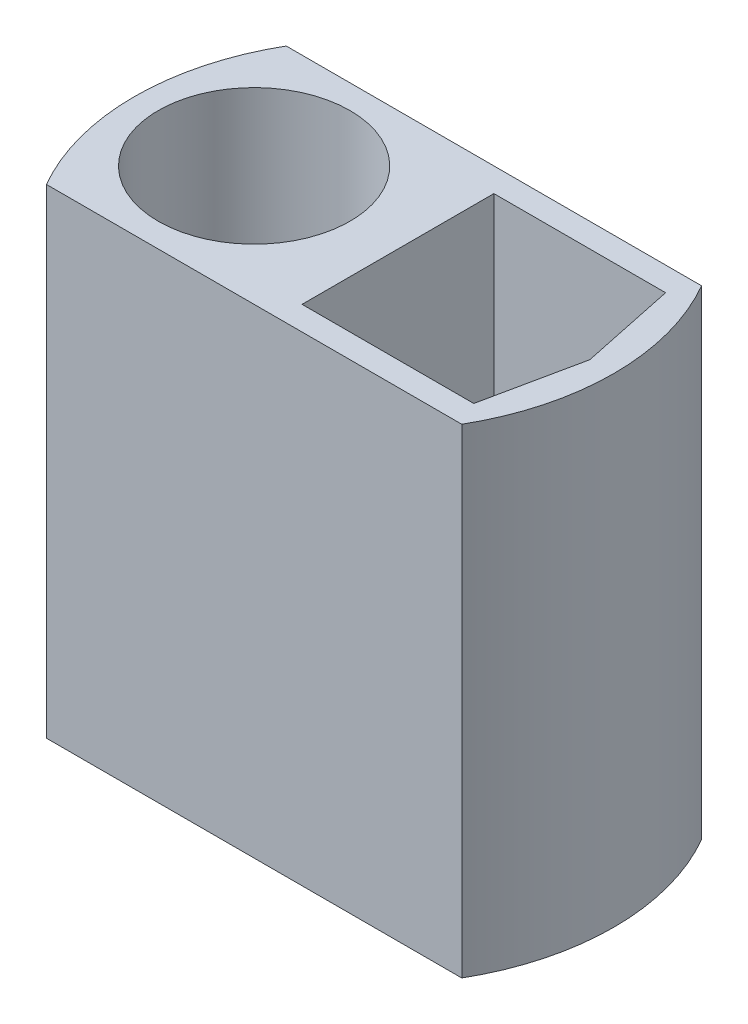
ISO-10303-21;
HEADER;
FILE_DESCRIPTION(('STEP AP214'),'2;1');
FILE_NAME('part.step','',(''),(''),'','','');
FILE_SCHEMA(('AUTOMOTIVE_DESIGN { 1 0 10303 214 1 1 1 1 }'));
ENDSEC;
DATA;
#1=APPLICATION_CONTEXT('core data for automotive mechanical design processes');
#2=APPLICATION_PROTOCOL_DEFINITION('international standard','automotive_design',2000,#1);
#3=PRODUCT_CONTEXT('',#1,'mechanical');
#4=PRODUCT('Part','Part','',(#3));
#5=PRODUCT_RELATED_PRODUCT_CATEGORY('part','',(#4));
#6=PRODUCT_DEFINITION_FORMATION('','',#4);
#7=PRODUCT_DEFINITION_CONTEXT('part definition',#1,'design');
#8=PRODUCT_DEFINITION('design','',#6,#7);
#9=PRODUCT_DEFINITION_SHAPE('','',#8);
#10=(LENGTH_UNIT() NAMED_UNIT(*) SI_UNIT(.MILLI.,.METRE.));
#11=(NAMED_UNIT(*) PLANE_ANGLE_UNIT() SI_UNIT($,.RADIAN.));
#12=(NAMED_UNIT(*) SI_UNIT($,.STERADIAN.) SOLID_ANGLE_UNIT());
#13=UNCERTAINTY_MEASURE_WITH_UNIT(LENGTH_MEASURE(1.E-05),#10,'distance_accuracy_value','');
#14=(GEOMETRIC_REPRESENTATION_CONTEXT(3) GLOBAL_UNCERTAINTY_ASSIGNED_CONTEXT((#13)) GLOBAL_UNIT_ASSIGNED_CONTEXT((#10,
#11,#12)) REPRESENTATION_CONTEXT('',''));
#15=CARTESIAN_POINT('',(0.,0.,0.));
#16=DIRECTION('',(0.,0.,1.));
#17=DIRECTION('',(1.,0.,0.));
#18=AXIS2_PLACEMENT_3D('',#15,#16,#17);
#19=CARTESIAN_POINT('',(0.,25.4,6.35));
#20=DIRECTION('',(0.,0.,-1.));
#21=DIRECTION('',(-1.,0.,0.));
#22=AXIS2_PLACEMENT_3D('',#19,#20,#21);
#23=PLANE('',#22);
#24=DIRECTION('',(1.,0.,0.));
#25=VECTOR('',#24,1.);
#26=CARTESIAN_POINT('',(0.,0.,6.35));
#27=LINE('',#26,#25);
#28=CARTESIAN_POINT('',(-10.9985226280624,0.,6.35));
#29=VERTEX_POINT('',#28);
#30=CARTESIAN_POINT('',(10.9985226280624,0.,6.35));
#31=VERTEX_POINT('',#30);
#32=EDGE_CURVE('E132',#29,#31,#27,.T.);
#33=ORIENTED_EDGE('',*,*,#32,.T.);
#34=DIRECTION('',(0.,-1.,0.));
#35=VECTOR('',#34,1.);
#36=CARTESIAN_POINT('',(10.9985226280624,25.4,6.35));
#37=LINE('',#36,#35);
#38=CARTESIAN_POINT('',(10.9985226280624,25.4,6.35));
#39=VERTEX_POINT('',#38);
#40=EDGE_CURVE('E43',#39,#31,#37,.T.);
#41=ORIENTED_EDGE('',*,*,#40,.F.);
#42=DIRECTION('',(1.,0.,0.));
#43=VECTOR('',#42,1.);
#44=CARTESIAN_POINT('',(0.,25.4,6.35));
#45=LINE('',#44,#43);
#46=CARTESIAN_POINT('',(-10.9985226280624,25.4,6.35));
#47=VERTEX_POINT('',#46);
#48=EDGE_CURVE('E113',#47,#39,#45,.T.);
#49=ORIENTED_EDGE('',*,*,#48,.F.);
#50=DIRECTION('',(0.,-1.,0.));
#51=VECTOR('',#50,1.);
#52=CARTESIAN_POINT('',(-10.9985226280624,25.4,6.35));
#53=LINE('',#52,#51);
#54=EDGE_CURVE('E139',#47,#29,#53,.T.);
#55=ORIENTED_EDGE('',*,*,#54,.T.);
#56=EDGE_LOOP('',(#33,#41,#49,#55));
#57=FACE_BOUND('',#56,.T.);
#58=ADVANCED_FACE('F35',(#57),#23,.F.);
#59=CARTESIAN_POINT('',(0.,25.4,0.));
#60=DIRECTION('',(0.,-1.,0.));
#61=DIRECTION('',(0.,0.,-1.));
#62=AXIS2_PLACEMENT_3D('',#59,#60,#61);
#63=CYLINDRICAL_SURFACE('',#62,12.7);
#64=CARTESIAN_POINT('',(0.,0.,0.));
#65=DIRECTION('',(0.,1.,0.));
#66=DIRECTION('',(0.,0.,1.));
#67=AXIS2_PLACEMENT_3D('',#64,#65,#66);
#68=CIRCLE('',#67,12.7);
#69=CARTESIAN_POINT('',(10.9985226280624,0.,-6.35));
#70=VERTEX_POINT('',#69);
#71=EDGE_CURVE('E121',#31,#70,#68,.T.);
#72=ORIENTED_EDGE('',*,*,#71,.T.);
#73=DIRECTION('',(0.,-1.,0.));
#74=VECTOR('',#73,1.);
#75=CARTESIAN_POINT('',(10.9985226280624,25.4,-6.35));
#76=LINE('',#75,#74);
#77=CARTESIAN_POINT('',(10.9985226280624,25.4,-6.35));
#78=VERTEX_POINT('',#77);
#79=EDGE_CURVE('E119',#78,#70,#76,.T.);
#80=ORIENTED_EDGE('',*,*,#79,.F.);
#81=CARTESIAN_POINT('',(0.,25.4,0.));
#82=DIRECTION('',(0.,1.,0.));
#83=DIRECTION('',(0.,0.,1.));
#84=AXIS2_PLACEMENT_3D('',#81,#82,#83);
#85=CIRCLE('',#84,12.7);
#86=EDGE_CURVE('E107',#39,#78,#85,.T.);
#87=ORIENTED_EDGE('',*,*,#86,.F.);
#88=ORIENTED_EDGE('',*,*,#40,.T.);
#89=EDGE_LOOP('',(#72,#80,#87,#88));
#90=FACE_BOUND('',#89,.T.);
#91=ADVANCED_FACE('F120',(#90),#63,.T.);
#92=CARTESIAN_POINT('',(0.,25.4,-6.35));
#93=DIRECTION('',(0.,0.,-1.));
#94=DIRECTION('',(-1.,0.,0.));
#95=AXIS2_PLACEMENT_3D('',#92,#93,#94);
#96=PLANE('',#95);
#97=DIRECTION('',(1.,0.,0.));
#98=VECTOR('',#97,1.);
#99=CARTESIAN_POINT('',(0.,0.,-6.35));
#100=LINE('',#99,#98);
#101=CARTESIAN_POINT('',(-10.9985226280624,0.,-6.35));
#102=VERTEX_POINT('',#101);
#103=EDGE_CURVE('E137',#102,#70,#100,.T.);
#104=ORIENTED_EDGE('',*,*,#103,.F.);
#105=DIRECTION('',(0.,-1.,0.));
#106=VECTOR('',#105,1.);
#107=CARTESIAN_POINT('',(-10.9985226280624,25.4,-6.35));
#108=LINE('',#107,#106);
#109=CARTESIAN_POINT('',(-10.9985226280624,25.4,-6.35));
#110=VERTEX_POINT('',#109);
#111=EDGE_CURVE('E125',#110,#102,#108,.T.);
#112=ORIENTED_EDGE('',*,*,#111,.F.);
#113=DIRECTION('',(1.,0.,0.));
#114=VECTOR('',#113,1.);
#115=CARTESIAN_POINT('',(0.,25.4,-6.35));
#116=LINE('',#115,#114);
#117=EDGE_CURVE('E111',#110,#78,#116,.T.);
#118=ORIENTED_EDGE('',*,*,#117,.T.);
#119=ORIENTED_EDGE('',*,*,#79,.T.);
#120=EDGE_LOOP('',(#104,#112,#118,#119));
#121=FACE_BOUND('',#120,.T.);
#122=ADVANCED_FACE('F127',(#121),#96,.T.);
#123=CARTESIAN_POINT('',(0.,25.4,5.08));
#124=DIRECTION('',(0.,0.,1.));
#125=DIRECTION('',(1.,0.,0.));
#126=AXIS2_PLACEMENT_3D('',#123,#124,#125);
#127=PLANE('',#126);
#128=DIRECTION('',(0.,-1.,0.));
#129=VECTOR('',#128,1.);
#130=CARTESIAN_POINT('',(10.3639461184403,25.4,5.08));
#131=LINE('',#130,#129);
#132=CARTESIAN_POINT('',(10.3639461184403,25.4,5.08));
#133=VERTEX_POINT('',#132);
#134=CARTESIAN_POINT('',(10.3639461184403,1.27,5.08));
#135=VERTEX_POINT('',#134);
#136=EDGE_CURVE('E129',#133,#135,#131,.T.);
#137=ORIENTED_EDGE('',*,*,#136,.T.);
#138=DIRECTION('',(-1.,0.,0.));
#139=VECTOR('',#138,1.);
#140=CARTESIAN_POINT('',(0.,1.27,5.08));
#141=LINE('',#140,#139);
#142=CARTESIAN_POINT('',(1.27,1.27,5.08));
#143=VERTEX_POINT('',#142);
#144=EDGE_CURVE('E50',#135,#143,#141,.T.);
#145=ORIENTED_EDGE('',*,*,#144,.T.);
#146=DIRECTION('',(0.,-1.,0.));
#147=VECTOR('',#146,1.);
#148=CARTESIAN_POINT('',(1.27,25.4,5.08));
#149=LINE('',#148,#147);
#150=CARTESIAN_POINT('',(1.27,25.4,5.08));
#151=VERTEX_POINT('',#150);
#152=EDGE_CURVE('E141',#151,#143,#149,.T.);
#153=ORIENTED_EDGE('',*,*,#152,.F.);
#154=DIRECTION('',(-1.,0.,0.));
#155=VECTOR('',#154,1.);
#156=CARTESIAN_POINT('',(0.,25.4,5.08));
#157=LINE('',#156,#155);
#158=EDGE_CURVE('E164',#133,#151,#157,.T.);
#159=ORIENTED_EDGE('',*,*,#158,.F.);
#160=EDGE_LOOP('',(#137,#145,#153,#159));
#161=FACE_BOUND('',#160,.T.);
#162=ADVANCED_FACE('F163',(#161),#127,.F.);
#163=CARTESIAN_POINT('',(1.27,25.4,0.));
#164=DIRECTION('',(-1.,0.,0.));
#165=DIRECTION('',(0.,0.,1.));
#166=AXIS2_PLACEMENT_3D('',#163,#164,#165);
#167=PLANE('',#166);
#168=ORIENTED_EDGE('',*,*,#152,.T.);
#169=DIRECTION('',(0.,0.,-1.));
#170=VECTOR('',#169,1.);
#171=CARTESIAN_POINT('',(1.27,1.27,0.));
#172=LINE('',#171,#170);
#173=CARTESIAN_POINT('',(1.27,1.27,-5.08));
#174=VERTEX_POINT('',#173);
#175=EDGE_CURVE('E158',#143,#174,#172,.T.);
#176=ORIENTED_EDGE('',*,*,#175,.T.);
#177=DIRECTION('',(0.,-1.,0.));
#178=VECTOR('',#177,1.);
#179=CARTESIAN_POINT('',(1.27,25.4,-5.08));
#180=LINE('',#179,#178);
#181=CARTESIAN_POINT('',(1.27,25.4,-5.08));
#182=VERTEX_POINT('',#181);
#183=EDGE_CURVE('E152',#182,#174,#180,.T.);
#184=ORIENTED_EDGE('',*,*,#183,.F.);
#185=DIRECTION('',(0.,0.,-1.));
#186=VECTOR('',#185,1.);
#187=CARTESIAN_POINT('',(1.27,25.4,0.));
#188=LINE('',#187,#186);
#189=EDGE_CURVE('E89',#151,#182,#188,.T.);
#190=ORIENTED_EDGE('',*,*,#189,.F.);
#191=EDGE_LOOP('',(#168,#176,#184,#190));
#192=FACE_BOUND('',#191,.T.);
#193=ADVANCED_FACE('F157',(#192),#167,.F.);
#194=CARTESIAN_POINT('',(0.,25.4,-5.08));
#195=DIRECTION('',(0.,0.,-1.));
#196=DIRECTION('',(-1.,0.,0.));
#197=AXIS2_PLACEMENT_3D('',#194,#195,#196);
#198=PLANE('',#197);
#199=ORIENTED_EDGE('',*,*,#183,.T.);
#200=DIRECTION('',(1.,0.,0.));
#201=VECTOR('',#200,1.);
#202=CARTESIAN_POINT('',(0.,1.27,-5.08));
#203=LINE('',#202,#201);
#204=CARTESIAN_POINT('',(10.3639461184403,1.27,-5.08));
#205=VERTEX_POINT('',#204);
#206=EDGE_CURVE('E176',#174,#205,#203,.T.);
#207=ORIENTED_EDGE('',*,*,#206,.T.);
#208=DIRECTION('',(0.,-1.,0.));
#209=VECTOR('',#208,1.);
#210=CARTESIAN_POINT('',(10.3639461184403,25.4,-5.08));
#211=LINE('',#210,#209);
#212=CARTESIAN_POINT('',(10.3639461184403,25.4,-5.08));
#213=VERTEX_POINT('',#212);
#214=EDGE_CURVE('E149',#213,#205,#211,.T.);
#215=ORIENTED_EDGE('',*,*,#214,.F.);
#216=DIRECTION('',(1.,0.,0.));
#217=VECTOR('',#216,1.);
#218=CARTESIAN_POINT('',(0.,25.4,-5.08));
#219=LINE('',#218,#217);
#220=EDGE_CURVE('E205',#182,#213,#219,.T.);
#221=ORIENTED_EDGE('',*,*,#220,.F.);
#222=EDGE_LOOP('',(#199,#207,#215,#221));
#223=FACE_BOUND('',#222,.T.);
#224=ADVANCED_FACE('F226',(#223),#198,.F.);
#225=CARTESIAN_POINT('',(10.9478738673168,25.4,-2.29744555729909));
#226=DIRECTION('',(0.9786823979135,0.,-0.2053795608484));
#227=DIRECTION('',(-0.2053795608484,0.,-0.9786823979135));
#228=AXIS2_PLACEMENT_3D('',#225,#226,#227);
#229=PLANE('',#228);
#230=ORIENTED_EDGE('',*,*,#214,.T.);
#231=DIRECTION('',(0.2053795608484,0.,0.9786823979135));
#232=VECTOR('',#231,1.);
#233=CARTESIAN_POINT('',(10.9478738673168,1.27,-2.29744555729909));
#234=LINE('',#233,#232);
#235=CARTESIAN_POINT('',(11.43,1.27,0.));
#236=VERTEX_POINT('',#235);
#237=EDGE_CURVE('E168',#205,#236,#234,.T.);
#238=ORIENTED_EDGE('',*,*,#237,.T.);
#239=DIRECTION('',(0.,-1.,0.));
#240=VECTOR('',#239,1.);
#241=CARTESIAN_POINT('',(11.43,25.4,0.));
#242=LINE('',#241,#240);
#243=CARTESIAN_POINT('',(11.43,25.4,0.));
#244=VERTEX_POINT('',#243);
#245=EDGE_CURVE('E146',#244,#236,#242,.T.);
#246=ORIENTED_EDGE('',*,*,#245,.F.);
#247=DIRECTION('',(0.2053795608484,0.,0.9786823979135));
#248=VECTOR('',#247,1.);
#249=CARTESIAN_POINT('',(10.9478738673168,25.4,-2.29744555729909));
#250=LINE('',#249,#248);
#251=EDGE_CURVE('E207',#213,#244,#250,.T.);
#252=ORIENTED_EDGE('',*,*,#251,.F.);
#253=EDGE_LOOP('',(#230,#238,#246,#252));
#254=FACE_BOUND('',#253,.T.);
#255=ADVANCED_FACE('F222',(#254),#229,.F.);
#256=CARTESIAN_POINT('',(10.9478738673168,25.4,2.29744555729909));
#257=DIRECTION('',(0.9786823979135,0.,0.2053795608484));
#258=DIRECTION('',(0.2053795608484,0.,-0.9786823979135));
#259=AXIS2_PLACEMENT_3D('',#256,#257,#258);
#260=PLANE('',#259);
#261=ORIENTED_EDGE('',*,*,#245,.T.);
#262=DIRECTION('',(-0.2053795608484,0.,0.9786823979135));
#263=VECTOR('',#262,1.);
#264=CARTESIAN_POINT('',(10.9478738673168,1.27,2.29744555729909));
#265=LINE('',#264,#263);
#266=EDGE_CURVE('E166',#236,#135,#265,.T.);
#267=ORIENTED_EDGE('',*,*,#266,.T.);
#268=ORIENTED_EDGE('',*,*,#136,.F.);
#269=DIRECTION('',(-0.2053795608484,0.,0.9786823979135));
#270=VECTOR('',#269,1.);
#271=CARTESIAN_POINT('',(10.9478738673168,25.4,2.29744555729909));
#272=LINE('',#271,#270);
#273=EDGE_CURVE('E209',#244,#133,#272,.T.);
#274=ORIENTED_EDGE('',*,*,#273,.F.);
#275=EDGE_LOOP('',(#261,#267,#268,#274));
#276=FACE_BOUND('',#275,.T.);
#277=ADVANCED_FACE('F215',(#276),#260,.F.);
#278=CARTESIAN_POINT('',(-6.35,25.4,0.));
#279=DIRECTION('',(0.,-1.,0.));
#280=DIRECTION('',(0.,0.,-1.));
#281=AXIS2_PLACEMENT_3D('',#278,#279,#280);
#282=CYLINDRICAL_SURFACE('',#281,5.08);
#283=CARTESIAN_POINT('',(-6.35,1.27,0.));
#284=DIRECTION('',(0.,1.,0.));
#285=DIRECTION('',(0.,0.,1.));
#286=AXIS2_PLACEMENT_3D('',#283,#284,#285);
#287=CIRCLE('',#286,5.08);
#288=CARTESIAN_POINT('',(-6.35,1.27,5.08));
#289=VERTEX_POINT('',#288);
#290=EDGE_CURVE('E11',#289,#289,#287,.T.);
#291=ORIENTED_EDGE('',*,*,#290,.F.);
#292=EDGE_LOOP('',(#291));
#293=FACE_BOUND('',#292,.T.);
#294=CARTESIAN_POINT('',(-6.35,25.4,0.));
#295=DIRECTION('',(0.,1.,0.));
#296=DIRECTION('',(0.,0.,1.));
#297=AXIS2_PLACEMENT_3D('',#294,#295,#296);
#298=CIRCLE('',#297,5.08);
#299=CARTESIAN_POINT('',(-6.35,25.4,5.08));
#300=VERTEX_POINT('',#299);
#301=EDGE_CURVE('E200',#300,#300,#298,.T.);
#302=ORIENTED_EDGE('',*,*,#301,.T.);
#303=EDGE_LOOP('',(#302));
#304=FACE_BOUND('',#303,.T.);
#305=ADVANCED_FACE('F37',(#293,#304),#282,.F.);
#306=EDGE_CURVE('E80',#102,#29,#68,.T.);
#307=ORIENTED_EDGE('',*,*,#306,.T.);
#308=ORIENTED_EDGE('',*,*,#54,.F.);
#309=EDGE_CURVE('E59',#110,#47,#85,.T.);
#310=ORIENTED_EDGE('',*,*,#309,.F.);
#311=ORIENTED_EDGE('',*,*,#111,.T.);
#312=EDGE_LOOP('',(#307,#308,#310,#311));
#313=FACE_BOUND('',#312,.T.);
#314=ADVANCED_FACE('F242',(#313),#63,.T.);
#315=CARTESIAN_POINT('',(0.,25.4,0.));
#316=DIRECTION('',(0.,1.,0.));
#317=DIRECTION('',(0.,0.,1.));
#318=AXIS2_PLACEMENT_3D('',#315,#316,#317);
#319=PLANE('',#318);
#320=ORIENTED_EDGE('',*,*,#301,.F.);
#321=EDGE_LOOP('',(#320));
#322=FACE_BOUND('',#321,.T.);
#323=ORIENTED_EDGE('',*,*,#158,.T.);
#324=ORIENTED_EDGE('',*,*,#189,.T.);
#325=ORIENTED_EDGE('',*,*,#220,.T.);
#326=ORIENTED_EDGE('',*,*,#251,.T.);
#327=ORIENTED_EDGE('',*,*,#273,.T.);
#328=EDGE_LOOP('',(#323,#324,#325,#326,#327));
#329=FACE_BOUND('',#328,.T.);
#330=ORIENTED_EDGE('',*,*,#48,.T.);
#331=ORIENTED_EDGE('',*,*,#86,.T.);
#332=ORIENTED_EDGE('',*,*,#117,.F.);
#333=ORIENTED_EDGE('',*,*,#309,.T.);
#334=EDGE_LOOP('',(#330,#331,#332,#333));
#335=FACE_BOUND('',#334,.T.);
#336=ADVANCED_FACE('F109',(#322,#329,#335),#319,.T.);
#337=CARTESIAN_POINT('',(0.,0.,0.));
#338=DIRECTION('',(0.,1.,0.));
#339=DIRECTION('',(0.,0.,1.));
#340=AXIS2_PLACEMENT_3D('',#337,#338,#339);
#341=PLANE('',#340);
#342=ORIENTED_EDGE('',*,*,#32,.F.);
#343=ORIENTED_EDGE('',*,*,#306,.F.);
#344=ORIENTED_EDGE('',*,*,#103,.T.);
#345=ORIENTED_EDGE('',*,*,#71,.F.);
#346=EDGE_LOOP('',(#342,#343,#344,#345));
#347=FACE_BOUND('',#346,.T.);
#348=CARTESIAN_POINT('',(-5.08,0.,0.));
#349=DIRECTION('',(0.,1.,0.));
#350=DIRECTION('',(0.,0.,1.));
#351=AXIS2_PLACEMENT_3D('',#348,#349,#350);
#352=CIRCLE('',#351,0.635000000000001);
#353=CARTESIAN_POINT('',(-5.08,0.,0.635000000000001));
#354=VERTEX_POINT('',#353);
#355=EDGE_CURVE('E179',#354,#354,#352,.T.);
#356=ORIENTED_EDGE('',*,*,#355,.T.);
#357=EDGE_LOOP('',(#356));
#358=FACE_BOUND('',#357,.T.);
#359=CARTESIAN_POINT('',(-7.62,0.,0.));
#360=DIRECTION('',(0.,1.,0.));
#361=DIRECTION('',(0.,0.,1.));
#362=AXIS2_PLACEMENT_3D('',#359,#360,#361);
#363=CIRCLE('',#362,0.635000000000001);
#364=CARTESIAN_POINT('',(-7.62,0.,0.635));
#365=VERTEX_POINT('',#364);
#366=EDGE_CURVE('E193',#365,#365,#363,.T.);
#367=ORIENTED_EDGE('',*,*,#366,.T.);
#368=EDGE_LOOP('',(#367));
#369=FACE_BOUND('',#368,.T.);
#370=CARTESIAN_POINT('',(9.20218077905927,0.,-2.54));
#371=DIRECTION('',(0.,1.,0.));
#372=DIRECTION('',(0.,0.,1.));
#373=AXIS2_PLACEMENT_3D('',#370,#371,#372);
#374=CIRCLE('',#373,0.635000000000001);
#375=CARTESIAN_POINT('',(9.20218077905927,0.,-1.905));
#376=VERTEX_POINT('',#375);
#377=EDGE_CURVE('E180',#376,#376,#374,.T.);
#378=ORIENTED_EDGE('',*,*,#377,.T.);
#379=EDGE_LOOP('',(#378));
#380=FACE_BOUND('',#379,.T.);
#381=CARTESIAN_POINT('',(6.35,0.,-2.54));
#382=DIRECTION('',(0.,1.,0.));
#383=DIRECTION('',(0.,0.,1.));
#384=AXIS2_PLACEMENT_3D('',#381,#382,#383);
#385=CIRCLE('',#384,0.635000000000001);
#386=CARTESIAN_POINT('',(6.35,0.,-1.905));
#387=VERTEX_POINT('',#386);
#388=EDGE_CURVE('E183',#387,#387,#385,.T.);
#389=ORIENTED_EDGE('',*,*,#388,.T.);
#390=EDGE_LOOP('',(#389));
#391=FACE_BOUND('',#390,.T.);
#392=CARTESIAN_POINT('',(3.52810369912332,0.,-2.54));
#393=DIRECTION('',(0.,1.,0.));
#394=DIRECTION('',(0.,0.,1.));
#395=AXIS2_PLACEMENT_3D('',#392,#393,#394);
#396=CIRCLE('',#395,0.635000000000001);
#397=CARTESIAN_POINT('',(3.52810369912332,0.,-1.905));
#398=VERTEX_POINT('',#397);
#399=EDGE_CURVE('E186',#398,#398,#396,.T.);
#400=ORIENTED_EDGE('',*,*,#399,.T.);
#401=EDGE_LOOP('',(#400));
#402=FACE_BOUND('',#401,.T.);
#403=ADVANCED_FACE('F258',(#347,#358,#369,#380,#391,#402),#341,.F.);
#404=CARTESIAN_POINT('',(-7.62,1.27,0.));
#405=DIRECTION('',(0.,-1.,0.));
#406=DIRECTION('',(0.,0.,-1.));
#407=AXIS2_PLACEMENT_3D('',#404,#405,#406);
#408=CYLINDRICAL_SURFACE('',#407,0.635000000000001);
#409=CARTESIAN_POINT('',(-7.62,1.27,0.));
#410=DIRECTION('',(0.,1.,0.));
#411=DIRECTION('',(0.,0.,1.));
#412=AXIS2_PLACEMENT_3D('',#409,#410,#411);
#413=CIRCLE('',#412,0.635000000000001);
#414=CARTESIAN_POINT('',(-7.62,1.27,0.635));
#415=VERTEX_POINT('',#414);
#416=EDGE_CURVE('E135',#415,#415,#413,.T.);
#417=ORIENTED_EDGE('',*,*,#416,.T.);
#418=EDGE_LOOP('',(#417));
#419=FACE_BOUND('',#418,.T.);
#420=ORIENTED_EDGE('',*,*,#366,.F.);
#421=EDGE_LOOP('',(#420));
#422=FACE_BOUND('',#421,.T.);
#423=ADVANCED_FACE('F263',(#419,#422),#408,.F.);
#424=CARTESIAN_POINT('',(-5.08,1.27,0.));
#425=DIRECTION('',(0.,-1.,0.));
#426=DIRECTION('',(0.,0.,-1.));
#427=AXIS2_PLACEMENT_3D('',#424,#425,#426);
#428=CYLINDRICAL_SURFACE('',#427,0.635000000000001);
#429=CARTESIAN_POINT('',(-5.08,1.27,0.));
#430=DIRECTION('',(0.,1.,0.));
#431=DIRECTION('',(0.,0.,1.));
#432=AXIS2_PLACEMENT_3D('',#429,#430,#431);
#433=CIRCLE('',#432,0.635000000000001);
#434=CARTESIAN_POINT('',(-5.08,1.27,0.635000000000001));
#435=VERTEX_POINT('',#434);
#436=EDGE_CURVE('E190',#435,#435,#433,.T.);
#437=ORIENTED_EDGE('',*,*,#436,.T.);
#438=EDGE_LOOP('',(#437));
#439=FACE_BOUND('',#438,.T.);
#440=ORIENTED_EDGE('',*,*,#355,.F.);
#441=EDGE_LOOP('',(#440));
#442=FACE_BOUND('',#441,.T.);
#443=ADVANCED_FACE('F267',(#439,#442),#428,.F.);
#444=CARTESIAN_POINT('',(0.,1.27,0.));
#445=DIRECTION('',(0.,1.,0.));
#446=DIRECTION('',(0.,0.,1.));
#447=AXIS2_PLACEMENT_3D('',#444,#445,#446);
#448=PLANE('',#447);
#449=ORIENTED_EDGE('',*,*,#436,.F.);
#450=EDGE_LOOP('',(#449));
#451=FACE_BOUND('',#450,.T.);
#452=ORIENTED_EDGE('',*,*,#416,.F.);
#453=EDGE_LOOP('',(#452));
#454=FACE_BOUND('',#453,.T.);
#455=ORIENTED_EDGE('',*,*,#290,.T.);
#456=EDGE_LOOP('',(#455));
#457=FACE_BOUND('',#456,.T.);
#458=ADVANCED_FACE('F270',(#451,#454,#457),#448,.T.);
#459=CARTESIAN_POINT('',(3.52810369912332,1.27,-2.54));
#460=DIRECTION('',(0.,-1.,0.));
#461=DIRECTION('',(0.,0.,-1.));
#462=AXIS2_PLACEMENT_3D('',#459,#460,#461);
#463=CYLINDRICAL_SURFACE('',#462,0.635000000000001);
#464=CARTESIAN_POINT('',(3.52810369912332,1.27,-2.54));
#465=DIRECTION('',(0.,1.,0.));
#466=DIRECTION('',(0.,0.,1.));
#467=AXIS2_PLACEMENT_3D('',#464,#465,#466);
#468=CIRCLE('',#467,0.635000000000001);
#469=CARTESIAN_POINT('',(3.52810369912332,1.27,-1.905));
#470=VERTEX_POINT('',#469);
#471=EDGE_CURVE('E170',#470,#470,#468,.T.);
#472=ORIENTED_EDGE('',*,*,#471,.T.);
#473=EDGE_LOOP('',(#472));
#474=FACE_BOUND('',#473,.T.);
#475=ORIENTED_EDGE('',*,*,#399,.F.);
#476=EDGE_LOOP('',(#475));
#477=FACE_BOUND('',#476,.T.);
#478=ADVANCED_FACE('F277',(#474,#477),#463,.F.);
#479=CARTESIAN_POINT('',(6.35,1.27,-2.54));
#480=DIRECTION('',(0.,-1.,0.));
#481=DIRECTION('',(0.,0.,-1.));
#482=AXIS2_PLACEMENT_3D('',#479,#480,#481);
#483=CYLINDRICAL_SURFACE('',#482,0.635000000000001);
#484=CARTESIAN_POINT('',(6.35,1.27,-2.54));
#485=DIRECTION('',(0.,1.,0.));
#486=DIRECTION('',(0.,0.,1.));
#487=AXIS2_PLACEMENT_3D('',#484,#485,#486);
#488=CIRCLE('',#487,0.635000000000001);
#489=CARTESIAN_POINT('',(6.35,1.27,-1.905));
#490=VERTEX_POINT('',#489);
#491=EDGE_CURVE('E300',#490,#490,#488,.T.);
#492=ORIENTED_EDGE('',*,*,#491,.T.);
#493=EDGE_LOOP('',(#492));
#494=FACE_BOUND('',#493,.T.);
#495=ORIENTED_EDGE('',*,*,#388,.F.);
#496=EDGE_LOOP('',(#495));
#497=FACE_BOUND('',#496,.T.);
#498=ADVANCED_FACE('F282',(#494,#497),#483,.F.);
#499=CARTESIAN_POINT('',(9.20218077905927,1.27,-2.54));
#500=DIRECTION('',(0.,-1.,0.));
#501=DIRECTION('',(0.,0.,-1.));
#502=AXIS2_PLACEMENT_3D('',#499,#500,#501);
#503=CYLINDRICAL_SURFACE('',#502,0.635000000000001);
#504=CARTESIAN_POINT('',(9.20218077905927,1.27,-2.54));
#505=DIRECTION('',(0.,1.,0.));
#506=DIRECTION('',(0.,0.,1.));
#507=AXIS2_PLACEMENT_3D('',#504,#505,#506);
#508=CIRCLE('',#507,0.635000000000001);
#509=CARTESIAN_POINT('',(9.20218077905927,1.27,-1.905));
#510=VERTEX_POINT('',#509);
#511=EDGE_CURVE('E189',#510,#510,#508,.T.);
#512=ORIENTED_EDGE('',*,*,#511,.T.);
#513=EDGE_LOOP('',(#512));
#514=FACE_BOUND('',#513,.T.);
#515=ORIENTED_EDGE('',*,*,#377,.F.);
#516=EDGE_LOOP('',(#515));
#517=FACE_BOUND('',#516,.T.);
#518=ADVANCED_FACE('F279',(#514,#517),#503,.F.);
#519=CARTESIAN_POINT('',(0.,1.27,0.));
#520=DIRECTION('',(0.,1.,0.));
#521=DIRECTION('',(0.,0.,1.));
#522=AXIS2_PLACEMENT_3D('',#519,#520,#521);
#523=PLANE('',#522);
#524=ORIENTED_EDGE('',*,*,#511,.F.);
#525=EDGE_LOOP('',(#524));
#526=FACE_BOUND('',#525,.T.);
#527=ORIENTED_EDGE('',*,*,#491,.F.);
#528=EDGE_LOOP('',(#527));
#529=FACE_BOUND('',#528,.T.);
#530=ORIENTED_EDGE('',*,*,#471,.F.);
#531=EDGE_LOOP('',(#530));
#532=FACE_BOUND('',#531,.T.);
#533=ORIENTED_EDGE('',*,*,#175,.F.);
#534=ORIENTED_EDGE('',*,*,#144,.F.);
#535=ORIENTED_EDGE('',*,*,#266,.F.);
#536=ORIENTED_EDGE('',*,*,#237,.F.);
#537=ORIENTED_EDGE('',*,*,#206,.F.);
#538=EDGE_LOOP('',(#533,#534,#535,#536,#537));
#539=FACE_BOUND('',#538,.T.);
#540=ADVANCED_FACE('F217',(#526,#529,#532,#539),#523,.T.);
#541=CLOSED_SHELL('',(#58,#91,#122,#162,#193,#224,#255,#277,#305,#314,#336,#403,#423,#443,#458,
#478,#498,#518,#540));
#542=MANIFOLD_SOLID_BREP('B2',#541);
#543=ADVANCED_BREP_SHAPE_REPRESENTATION('',(#18,#542),#14);
#544=SHAPE_DEFINITION_REPRESENTATION(#9,#543);
ENDSEC;
END-ISO-10303-21;
